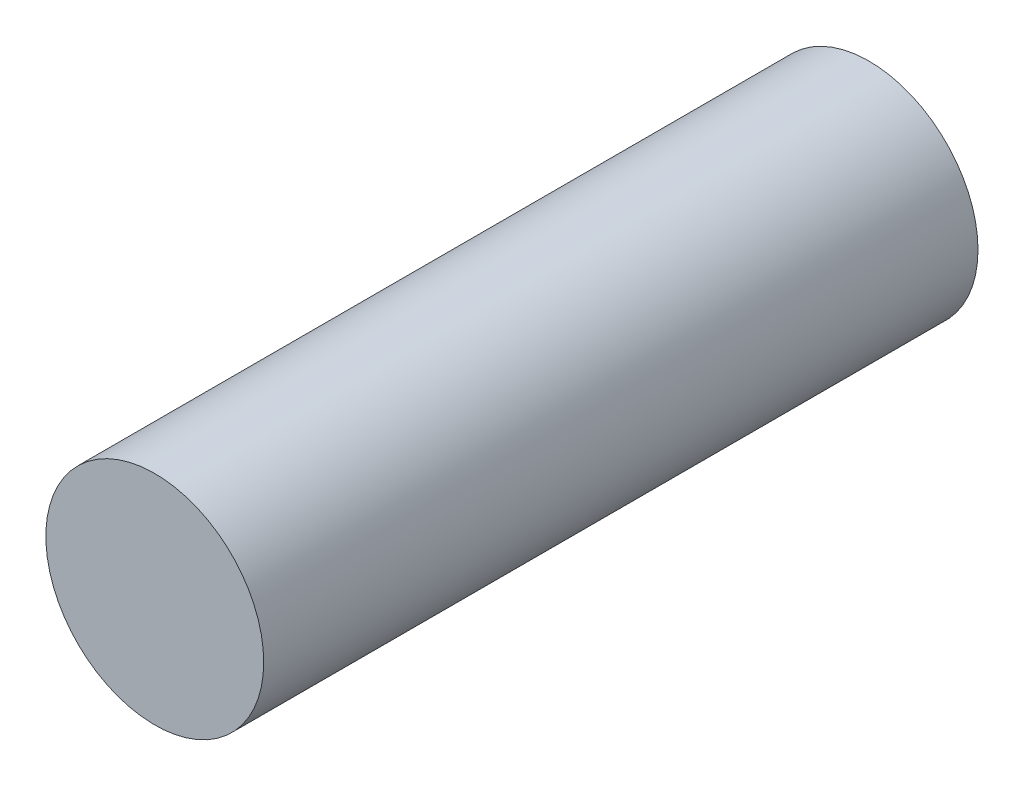
ISO-10303-21;
HEADER;
FILE_DESCRIPTION(('STEP AP214'),'2;1');
FILE_NAME('part.step','',(''),(''),'','','');
FILE_SCHEMA(('AUTOMOTIVE_DESIGN { 1 0 10303 214 1 1 1 1 }'));
ENDSEC;
DATA;
#1=APPLICATION_CONTEXT('core data for automotive mechanical design processes');
#2=APPLICATION_PROTOCOL_DEFINITION('international standard','automotive_design',2000,#1);
#3=PRODUCT_CONTEXT('',#1,'mechanical');
#4=PRODUCT('Part','Part','',(#3));
#5=PRODUCT_RELATED_PRODUCT_CATEGORY('part','',(#4));
#6=PRODUCT_DEFINITION_FORMATION('','',#4);
#7=PRODUCT_DEFINITION_CONTEXT('part definition',#1,'design');
#8=PRODUCT_DEFINITION('design','',#6,#7);
#9=PRODUCT_DEFINITION_SHAPE('','',#8);
#10=(LENGTH_UNIT() NAMED_UNIT(*) SI_UNIT(.MILLI.,.METRE.));
#11=(NAMED_UNIT(*) PLANE_ANGLE_UNIT() SI_UNIT($,.RADIAN.));
#12=(NAMED_UNIT(*) SI_UNIT($,.STERADIAN.) SOLID_ANGLE_UNIT());
#13=UNCERTAINTY_MEASURE_WITH_UNIT(LENGTH_MEASURE(1.E-05),#10,'distance_accuracy_value','');
#14=(GEOMETRIC_REPRESENTATION_CONTEXT(3) GLOBAL_UNCERTAINTY_ASSIGNED_CONTEXT((#13)) GLOBAL_UNIT_ASSIGNED_CONTEXT((#10,
#11,#12)) REPRESENTATION_CONTEXT('',''));
#15=CARTESIAN_POINT('',(0.,0.,0.));
#16=DIRECTION('',(0.,0.,1.));
#17=DIRECTION('',(1.,0.,0.));
#18=AXIS2_PLACEMENT_3D('',#15,#16,#17);
#19=CARTESIAN_POINT('',(8.5,4.,-17.));
#20=DIRECTION('',(0.,0.,1.));
#21=DIRECTION('',(1.,0.,0.));
#22=AXIS2_PLACEMENT_3D('',#19,#20,#21);
#23=CYLINDRICAL_SURFACE('',#22,3.05);
#24=CARTESIAN_POINT('',(8.5,4.,-17.));
#25=DIRECTION('',(0.,0.,1.));
#26=DIRECTION('',(1.,0.,0.));
#27=AXIS2_PLACEMENT_3D('',#24,#25,#26);
#28=CIRCLE('',#27,3.05);
#29=CARTESIAN_POINT('',(11.55,4.,-17.));
#30=VERTEX_POINT('',#29);
#31=EDGE_CURVE('E10',#30,#30,#28,.T.);
#32=ORIENTED_EDGE('',*,*,#31,.T.);
#33=EDGE_LOOP('',(#32));
#34=FACE_BOUND('',#33,.T.);
#35=CARTESIAN_POINT('',(8.5,4.,3.));
#36=DIRECTION('',(0.,0.,1.));
#37=DIRECTION('',(1.,0.,0.));
#38=AXIS2_PLACEMENT_3D('',#35,#36,#37);
#39=CIRCLE('',#38,3.05);
#40=CARTESIAN_POINT('',(11.55,4.,3.));
#41=VERTEX_POINT('',#40);
#42=EDGE_CURVE('E42',#41,#41,#39,.T.);
#43=ORIENTED_EDGE('',*,*,#42,.F.);
#44=EDGE_LOOP('',(#43));
#45=FACE_BOUND('',#44,.T.);
#46=ADVANCED_FACE('F36',(#34,#45),#23,.T.);
#47=CARTESIAN_POINT('',(8.5,4.,-17.));
#48=DIRECTION('',(0.,0.,1.));
#49=DIRECTION('',(1.,0.,0.));
#50=AXIS2_PLACEMENT_3D('',#47,#48,#49);
#51=PLANE('',#50);
#52=ORIENTED_EDGE('',*,*,#31,.F.);
#53=EDGE_LOOP('',(#52));
#54=FACE_BOUND('',#53,.T.);
#55=ADVANCED_FACE('F52',(#54),#51,.F.);
#56=CARTESIAN_POINT('',(8.5,4.,3.));
#57=DIRECTION('',(0.,0.,1.));
#58=DIRECTION('',(1.,0.,0.));
#59=AXIS2_PLACEMENT_3D('',#56,#57,#58);
#60=PLANE('',#59);
#61=ORIENTED_EDGE('',*,*,#42,.T.);
#62=EDGE_LOOP('',(#61));
#63=FACE_BOUND('',#62,.T.);
#64=ADVANCED_FACE('F49',(#63),#60,.T.);
#65=CLOSED_SHELL('',(#46,#55,#64));
#66=MANIFOLD_SOLID_BREP('B2',#65);
#67=ADVANCED_BREP_SHAPE_REPRESENTATION('',(#18,#66),#14);
#68=SHAPE_DEFINITION_REPRESENTATION(#9,#67);
ENDSEC;
END-ISO-10303-21;
